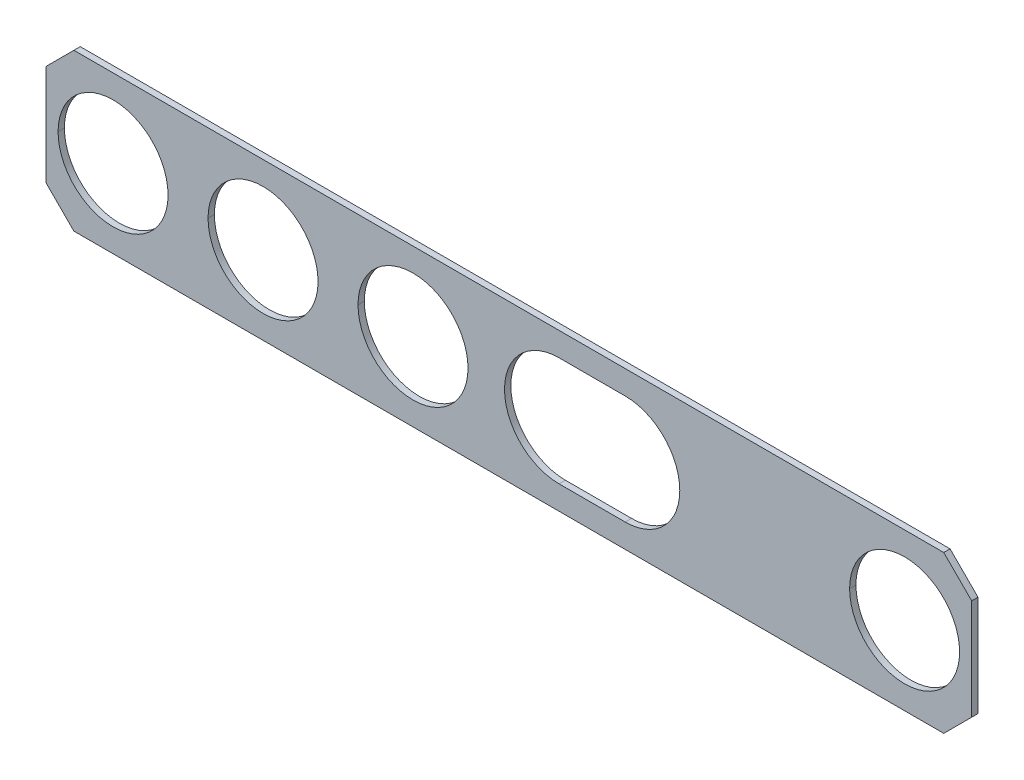
ISO-10303-21;
HEADER;
FILE_DESCRIPTION(('STEP AP214'),'2;1');
FILE_NAME('part.step','',(''),(''),'','','');
FILE_SCHEMA(('AUTOMOTIVE_DESIGN { 1 0 10303 214 1 1 1 1 }'));
ENDSEC;
DATA;
#1=APPLICATION_CONTEXT('core data for automotive mechanical design processes');
#2=APPLICATION_PROTOCOL_DEFINITION('international standard','automotive_design',2000,#1);
#3=PRODUCT_CONTEXT('',#1,'mechanical');
#4=PRODUCT('Part','Part','',(#3));
#5=PRODUCT_RELATED_PRODUCT_CATEGORY('part','',(#4));
#6=PRODUCT_DEFINITION_FORMATION('','',#4);
#7=PRODUCT_DEFINITION_CONTEXT('part definition',#1,'design');
#8=PRODUCT_DEFINITION('design','',#6,#7);
#9=PRODUCT_DEFINITION_SHAPE('','',#8);
#10=(LENGTH_UNIT() NAMED_UNIT(*) SI_UNIT(.MILLI.,.METRE.));
#11=(NAMED_UNIT(*) PLANE_ANGLE_UNIT() SI_UNIT($,.RADIAN.));
#12=(NAMED_UNIT(*) SI_UNIT($,.STERADIAN.) SOLID_ANGLE_UNIT());
#13=UNCERTAINTY_MEASURE_WITH_UNIT(LENGTH_MEASURE(1.E-05),#10,'distance_accuracy_value','');
#14=(GEOMETRIC_REPRESENTATION_CONTEXT(3) GLOBAL_UNCERTAINTY_ASSIGNED_CONTEXT((#13)) GLOBAL_UNIT_ASSIGNED_CONTEXT((#10,
#11,#12)) REPRESENTATION_CONTEXT('',''));
#15=CARTESIAN_POINT('',(0.,0.,0.));
#16=DIRECTION('',(0.,0.,1.));
#17=DIRECTION('',(1.,0.,0.));
#18=AXIS2_PLACEMENT_3D('',#15,#16,#17);
#19=CARTESIAN_POINT('',(13.96785551477,0.,-1.835));
#20=DIRECTION('',(0.,0.,1.));
#21=DIRECTION('',(1.,0.,0.));
#22=AXIS2_PLACEMENT_3D('',#19,#20,#21);
#23=CYLINDRICAL_SURFACE('',#22,6.55);
#24=DIRECTION('',(0.,0.,1.));
#25=VECTOR('',#24,1.);
#26=CARTESIAN_POINT('',(13.96785551477,6.55,-2.595));
#27=LINE('',#26,#25);
#28=CARTESIAN_POINT('',(13.96785551477,6.55,-2.595));
#29=VERTEX_POINT('',#28);
#30=CARTESIAN_POINT('',(13.96785551477,6.55,-1.835));
#31=VERTEX_POINT('',#30);
#32=EDGE_CURVE('E11',#29,#31,#27,.T.);
#33=ORIENTED_EDGE('',*,*,#32,.F.);
#34=CARTESIAN_POINT('',(13.96785551477,0.,-2.595));
#35=DIRECTION('',(0.,0.,-1.));
#36=DIRECTION('',(0.,1.,0.));
#37=AXIS2_PLACEMENT_3D('',#34,#35,#36);
#38=CIRCLE('',#37,6.55);
#39=CARTESIAN_POINT('',(20.51785551477,0.,-2.595));
#40=VERTEX_POINT('',#39);
#41=EDGE_CURVE('E294',#29,#40,#38,.T.);
#42=ORIENTED_EDGE('',*,*,#41,.T.);
#43=CARTESIAN_POINT('',(13.96785551477,0.,-2.595));
#44=DIRECTION('',(0.,0.,-1.));
#45=DIRECTION('',(1.,0.,0.));
#46=AXIS2_PLACEMENT_3D('',#43,#44,#45);
#47=CIRCLE('',#46,6.55);
#48=CARTESIAN_POINT('',(13.96785551477,-6.55,-2.595));
#49=VERTEX_POINT('',#48);
#50=EDGE_CURVE('E297',#40,#49,#47,.T.);
#51=ORIENTED_EDGE('',*,*,#50,.T.);
#52=DIRECTION('',(0.,0.,-1.));
#53=VECTOR('',#52,1.);
#54=CARTESIAN_POINT('',(13.96785551477,-6.55,-1.835));
#55=LINE('',#54,#53);
#56=CARTESIAN_POINT('',(13.96785551477,-6.55,-1.835));
#57=VERTEX_POINT('',#56);
#58=EDGE_CURVE('E304',#57,#49,#55,.T.);
#59=ORIENTED_EDGE('',*,*,#58,.F.);
#60=CARTESIAN_POINT('',(13.96785551477,0.,-1.835));
#61=DIRECTION('',(0.,0.,1.));
#62=DIRECTION('',(0.,-1.,0.));
#63=AXIS2_PLACEMENT_3D('',#60,#61,#62);
#64=CIRCLE('',#63,6.55);
#65=CARTESIAN_POINT('',(20.51785551477,0.,-1.835));
#66=VERTEX_POINT('',#65);
#67=EDGE_CURVE('E323',#57,#66,#64,.T.);
#68=ORIENTED_EDGE('',*,*,#67,.T.);
#69=CARTESIAN_POINT('',(13.96785551477,0.,-1.835));
#70=DIRECTION('',(0.,0.,1.));
#71=DIRECTION('',(1.,0.,0.));
#72=AXIS2_PLACEMENT_3D('',#69,#70,#71);
#73=CIRCLE('',#72,6.55);
#74=EDGE_CURVE('E326',#66,#31,#73,.T.);
#75=ORIENTED_EDGE('',*,*,#74,.T.);
#76=EDGE_LOOP('',(#33,#42,#51,#59,#68,#75));
#77=FACE_BOUND('',#76,.T.);
#78=ADVANCED_FACE('F17',(#77),#23,.F.);
#79=CARTESIAN_POINT('',(6.032144485231,6.55,-1.835));
#80=DIRECTION('',(0.,-1.,0.));
#81=DIRECTION('',(0.,0.,-1.));
#82=AXIS2_PLACEMENT_3D('',#79,#80,#81);
#83=PLANE('',#82);
#84=DIRECTION('',(0.,0.,-1.));
#85=VECTOR('',#84,1.);
#86=CARTESIAN_POINT('',(6.032144485231,6.55,-1.835));
#87=LINE('',#86,#85);
#88=CARTESIAN_POINT('',(6.032144485231,6.55,-1.835));
#89=VERTEX_POINT('',#88);
#90=CARTESIAN_POINT('',(6.032144485231,6.55,-2.595));
#91=VERTEX_POINT('',#90);
#92=EDGE_CURVE('E21',#89,#91,#87,.T.);
#93=ORIENTED_EDGE('',*,*,#92,.T.);
#94=DIRECTION('',(-1.,0.,0.));
#95=VECTOR('',#94,1.);
#96=CARTESIAN_POINT('',(13.96785551477,6.55,-2.595));
#97=LINE('',#96,#95);
#98=EDGE_CURVE('E251',#29,#91,#97,.T.);
#99=ORIENTED_EDGE('',*,*,#98,.F.);
#100=ORIENTED_EDGE('',*,*,#32,.T.);
#101=DIRECTION('',(-1.,0.,0.));
#102=VECTOR('',#101,1.);
#103=CARTESIAN_POINT('',(13.96785551477,6.55,-1.835));
#104=LINE('',#103,#102);
#105=EDGE_CURVE('E382',#31,#89,#104,.T.);
#106=ORIENTED_EDGE('',*,*,#105,.T.);
#107=EDGE_LOOP('',(#93,#99,#100,#106));
#108=FACE_BOUND('',#107,.T.);
#109=ADVANCED_FACE('F448',(#108),#83,.T.);
#110=CARTESIAN_POINT('',(6.032144485231,0.,-1.835));
#111=DIRECTION('',(0.,0.,1.));
#112=DIRECTION('',(1.,0.,0.));
#113=AXIS2_PLACEMENT_3D('',#110,#111,#112);
#114=CYLINDRICAL_SURFACE('',#113,6.55);
#115=DIRECTION('',(0.,0.,1.));
#116=VECTOR('',#115,1.);
#117=CARTESIAN_POINT('',(6.032144485231,-6.55,-2.595));
#118=LINE('',#117,#116);
#119=CARTESIAN_POINT('',(6.032144485231,-6.55,-2.595));
#120=VERTEX_POINT('',#119);
#121=CARTESIAN_POINT('',(6.032144485231,-6.55,-1.835));
#122=VERTEX_POINT('',#121);
#123=EDGE_CURVE('E41',#120,#122,#118,.T.);
#124=ORIENTED_EDGE('',*,*,#123,.F.);
#125=CARTESIAN_POINT('',(6.032144485231,0.,-2.595));
#126=DIRECTION('',(0.,0.,-1.));
#127=DIRECTION('',(0.,-1.,0.));
#128=AXIS2_PLACEMENT_3D('',#125,#126,#127);
#129=CIRCLE('',#128,6.55);
#130=CARTESIAN_POINT('',(-0.517855514769,0.,-2.595));
#131=VERTEX_POINT('',#130);
#132=EDGE_CURVE('E250',#120,#131,#129,.T.);
#133=ORIENTED_EDGE('',*,*,#132,.T.);
#134=CARTESIAN_POINT('',(6.032144485231,0.,-2.595));
#135=DIRECTION('',(0.,0.,-1.));
#136=DIRECTION('',(-1.,0.,0.));
#137=AXIS2_PLACEMENT_3D('',#134,#135,#136);
#138=CIRCLE('',#137,6.55);
#139=EDGE_CURVE('E246',#131,#91,#138,.T.);
#140=ORIENTED_EDGE('',*,*,#139,.T.);
#141=ORIENTED_EDGE('',*,*,#92,.F.);
#142=CARTESIAN_POINT('',(6.032144485231,0.,-1.835));
#143=DIRECTION('',(0.,0.,1.));
#144=DIRECTION('',(0.,1.,0.));
#145=AXIS2_PLACEMENT_3D('',#142,#143,#144);
#146=CIRCLE('',#145,6.55);
#147=CARTESIAN_POINT('',(-0.517855514769,0.,-1.835));
#148=VERTEX_POINT('',#147);
#149=EDGE_CURVE('E334',#89,#148,#146,.T.);
#150=ORIENTED_EDGE('',*,*,#149,.T.);
#151=CARTESIAN_POINT('',(6.032144485231,0.,-1.835));
#152=DIRECTION('',(0.,0.,1.));
#153=DIRECTION('',(-1.,0.,0.));
#154=AXIS2_PLACEMENT_3D('',#151,#152,#153);
#155=CIRCLE('',#154,6.55);
#156=EDGE_CURVE('E331',#148,#122,#155,.T.);
#157=ORIENTED_EDGE('',*,*,#156,.T.);
#158=EDGE_LOOP('',(#124,#133,#140,#141,#150,#157));
#159=FACE_BOUND('',#158,.T.);
#160=ADVANCED_FACE('F446',(#159),#114,.F.);
#161=CARTESIAN_POINT('',(13.96785551477,-6.55,-1.835));
#162=DIRECTION('',(0.,1.,0.));
#163=DIRECTION('',(1.,0.,0.));
#164=AXIS2_PLACEMENT_3D('',#161,#162,#163);
#165=PLANE('',#164);
#166=ORIENTED_EDGE('',*,*,#58,.T.);
#167=DIRECTION('',(1.,0.,0.));
#168=VECTOR('',#167,1.);
#169=CARTESIAN_POINT('',(6.032144485231,-6.55,-2.595));
#170=LINE('',#169,#168);
#171=EDGE_CURVE('E216',#120,#49,#170,.T.);
#172=ORIENTED_EDGE('',*,*,#171,.F.);
#173=ORIENTED_EDGE('',*,*,#123,.T.);
#174=DIRECTION('',(1.,0.,0.));
#175=VECTOR('',#174,1.);
#176=CARTESIAN_POINT('',(6.032144485231,-6.55,-1.835));
#177=LINE('',#176,#175);
#178=EDGE_CURVE('E239',#122,#57,#177,.T.);
#179=ORIENTED_EDGE('',*,*,#178,.T.);
#180=EDGE_LOOP('',(#166,#172,#173,#179));
#181=FACE_BOUND('',#180,.T.);
#182=ADVANCED_FACE('F434',(#181),#165,.T.);
#183=CARTESIAN_POINT('',(47.5,0.,-1.835));
#184=DIRECTION('',(0.,0.,1.));
#185=DIRECTION('',(1.,0.,0.));
#186=AXIS2_PLACEMENT_3D('',#183,#184,#185);
#187=CYLINDRICAL_SURFACE('',#186,6.6);
#188=DIRECTION('',(0.,0.,1.));
#189=VECTOR('',#188,1.);
#190=CARTESIAN_POINT('',(54.1,0.,-2.595));
#191=LINE('',#190,#189);
#192=CARTESIAN_POINT('',(54.1,0.,-2.595));
#193=VERTEX_POINT('',#192);
#194=CARTESIAN_POINT('',(54.1,0.,-1.835));
#195=VERTEX_POINT('',#194);
#196=EDGE_CURVE('E307',#193,#195,#191,.T.);
#197=ORIENTED_EDGE('',*,*,#196,.F.);
#198=CARTESIAN_POINT('',(47.5,0.,-2.595));
#199=DIRECTION('',(0.,0.,-1.));
#200=DIRECTION('',(1.,0.,0.));
#201=AXIS2_PLACEMENT_3D('',#198,#199,#200);
#202=CIRCLE('',#201,6.6);
#203=CARTESIAN_POINT('',(40.9,0.,-2.595));
#204=VERTEX_POINT('',#203);
#205=EDGE_CURVE('E288',#193,#204,#202,.T.);
#206=ORIENTED_EDGE('',*,*,#205,.T.);
#207=DIRECTION('',(0.,0.,1.));
#208=VECTOR('',#207,1.);
#209=CARTESIAN_POINT('',(40.9,0.,-2.595));
#210=LINE('',#209,#208);
#211=CARTESIAN_POINT('',(40.9,0.,-1.835));
#212=VERTEX_POINT('',#211);
#213=EDGE_CURVE('E262',#204,#212,#210,.T.);
#214=ORIENTED_EDGE('',*,*,#213,.T.);
#215=CARTESIAN_POINT('',(47.5,0.,-1.835));
#216=DIRECTION('',(0.,0.,1.));
#217=DIRECTION('',(-1.,0.,0.));
#218=AXIS2_PLACEMENT_3D('',#215,#216,#217);
#219=CIRCLE('',#218,6.6);
#220=EDGE_CURVE('E351',#212,#195,#219,.T.);
#221=ORIENTED_EDGE('',*,*,#220,.T.);
#222=EDGE_LOOP('',(#197,#206,#214,#221));
#223=FACE_BOUND('',#222,.T.);
#224=ADVANCED_FACE('F472',(#223),#187,.F.);
#225=CARTESIAN_POINT('',(47.5,0.,-1.835));
#226=DIRECTION('',(0.,0.,1.));
#227=DIRECTION('',(1.,0.,0.));
#228=AXIS2_PLACEMENT_3D('',#225,#226,#227);
#229=CYLINDRICAL_SURFACE('',#228,6.6);
#230=ORIENTED_EDGE('',*,*,#213,.F.);
#231=CARTESIAN_POINT('',(47.5,0.,-2.595));
#232=DIRECTION('',(0.,0.,-1.));
#233=DIRECTION('',(-1.,0.,0.));
#234=AXIS2_PLACEMENT_3D('',#231,#232,#233);
#235=CIRCLE('',#234,6.6);
#236=EDGE_CURVE('E292',#204,#193,#235,.T.);
#237=ORIENTED_EDGE('',*,*,#236,.T.);
#238=ORIENTED_EDGE('',*,*,#196,.T.);
#239=CARTESIAN_POINT('',(47.5,0.,-1.835));
#240=DIRECTION('',(0.,0.,1.));
#241=DIRECTION('',(1.,0.,0.));
#242=AXIS2_PLACEMENT_3D('',#239,#240,#241);
#243=CIRCLE('',#242,6.6);
#244=EDGE_CURVE('E335',#195,#212,#243,.T.);
#245=ORIENTED_EDGE('',*,*,#244,.T.);
#246=EDGE_LOOP('',(#230,#237,#238,#245));
#247=FACE_BOUND('',#246,.T.);
#248=ADVANCED_FACE('F498',(#247),#229,.F.);
#249=CARTESIAN_POINT('',(-47.5,0.,-1.835));
#250=DIRECTION('',(0.,0.,1.));
#251=DIRECTION('',(1.,0.,0.));
#252=AXIS2_PLACEMENT_3D('',#249,#250,#251);
#253=CYLINDRICAL_SURFACE('',#252,6.6);
#254=DIRECTION('',(0.,0.,1.));
#255=VECTOR('',#254,1.);
#256=CARTESIAN_POINT('',(-54.1,0.,-2.595));
#257=LINE('',#256,#255);
#258=CARTESIAN_POINT('',(-54.1,0.,-2.595));
#259=VERTEX_POINT('',#258);
#260=CARTESIAN_POINT('',(-54.1,0.,-1.835));
#261=VERTEX_POINT('',#260);
#262=EDGE_CURVE('E174',#259,#261,#257,.T.);
#263=ORIENTED_EDGE('',*,*,#262,.F.);
#264=CARTESIAN_POINT('',(-47.5,0.,-2.595));
#265=DIRECTION('',(0.,0.,-1.));
#266=DIRECTION('',(-1.,0.,0.));
#267=AXIS2_PLACEMENT_3D('',#264,#265,#266);
#268=CIRCLE('',#267,6.6);
#269=CARTESIAN_POINT('',(-40.9,0.,-2.595));
#270=VERTEX_POINT('',#269);
#271=EDGE_CURVE('E387',#259,#270,#268,.T.);
#272=ORIENTED_EDGE('',*,*,#271,.T.);
#273=DIRECTION('',(0.,0.,1.));
#274=VECTOR('',#273,1.);
#275=CARTESIAN_POINT('',(-40.9,0.,-2.595));
#276=LINE('',#275,#274);
#277=CARTESIAN_POINT('',(-40.9,0.,-1.835));
#278=VERTEX_POINT('',#277);
#279=EDGE_CURVE('E263',#270,#278,#276,.T.);
#280=ORIENTED_EDGE('',*,*,#279,.T.);
#281=CARTESIAN_POINT('',(-47.5,0.,-1.835));
#282=DIRECTION('',(0.,0.,1.));
#283=DIRECTION('',(1.,0.,0.));
#284=AXIS2_PLACEMENT_3D('',#281,#282,#283);
#285=CIRCLE('',#284,6.6);
#286=EDGE_CURVE('E318',#278,#261,#285,.T.);
#287=ORIENTED_EDGE('',*,*,#286,.T.);
#288=EDGE_LOOP('',(#263,#272,#280,#287));
#289=FACE_BOUND('',#288,.T.);
#290=ADVANCED_FACE('F489',(#289),#253,.F.);
#291=CARTESIAN_POINT('',(-47.5,0.,-1.835));
#292=DIRECTION('',(0.,0.,1.));
#293=DIRECTION('',(1.,0.,0.));
#294=AXIS2_PLACEMENT_3D('',#291,#292,#293);
#295=CYLINDRICAL_SURFACE('',#294,6.6);
#296=ORIENTED_EDGE('',*,*,#279,.F.);
#297=CARTESIAN_POINT('',(-47.5,0.,-2.595));
#298=DIRECTION('',(0.,0.,-1.));
#299=DIRECTION('',(1.,0.,0.));
#300=AXIS2_PLACEMENT_3D('',#297,#298,#299);
#301=CIRCLE('',#300,6.6);
#302=EDGE_CURVE('E293',#270,#259,#301,.T.);
#303=ORIENTED_EDGE('',*,*,#302,.T.);
#304=ORIENTED_EDGE('',*,*,#262,.T.);
#305=CARTESIAN_POINT('',(-47.5,0.,-1.835));
#306=DIRECTION('',(0.,0.,1.));
#307=DIRECTION('',(-1.,0.,0.));
#308=AXIS2_PLACEMENT_3D('',#305,#306,#307);
#309=CIRCLE('',#308,6.6);
#310=EDGE_CURVE('E347',#261,#278,#309,.T.);
#311=ORIENTED_EDGE('',*,*,#310,.T.);
#312=EDGE_LOOP('',(#296,#303,#304,#311));
#313=FACE_BOUND('',#312,.T.);
#314=ADVANCED_FACE('F484',(#313),#295,.F.);
#315=CARTESIAN_POINT('',(-29.5,0.,-1.835));
#316=DIRECTION('',(0.,0.,1.));
#317=DIRECTION('',(1.,0.,0.));
#318=AXIS2_PLACEMENT_3D('',#315,#316,#317);
#319=CYLINDRICAL_SURFACE('',#318,6.6);
#320=DIRECTION('',(0.,0.,1.));
#321=VECTOR('',#320,1.);
#322=CARTESIAN_POINT('',(-36.1,0.,-2.595));
#323=LINE('',#322,#321);
#324=CARTESIAN_POINT('',(-36.1,0.,-2.595));
#325=VERTEX_POINT('',#324);
#326=CARTESIAN_POINT('',(-36.1,0.,-1.835));
#327=VERTEX_POINT('',#326);
#328=EDGE_CURVE('E352',#325,#327,#323,.T.);
#329=ORIENTED_EDGE('',*,*,#328,.F.);
#330=CARTESIAN_POINT('',(-29.5,0.,-2.595));
#331=DIRECTION('',(0.,0.,-1.));
#332=DIRECTION('',(-1.,0.,0.));
#333=AXIS2_PLACEMENT_3D('',#330,#331,#332);
#334=CIRCLE('',#333,6.6);
#335=CARTESIAN_POINT('',(-22.9,0.,-2.595));
#336=VERTEX_POINT('',#335);
#337=EDGE_CURVE('E241',#325,#336,#334,.T.);
#338=ORIENTED_EDGE('',*,*,#337,.T.);
#339=DIRECTION('',(0.,0.,1.));
#340=VECTOR('',#339,1.);
#341=CARTESIAN_POINT('',(-22.9,0.,-2.595));
#342=LINE('',#341,#340);
#343=CARTESIAN_POINT('',(-22.9,0.,-1.835));
#344=VERTEX_POINT('',#343);
#345=EDGE_CURVE('E162',#336,#344,#342,.T.);
#346=ORIENTED_EDGE('',*,*,#345,.T.);
#347=CARTESIAN_POINT('',(-29.5,0.,-1.835));
#348=DIRECTION('',(0.,0.,1.));
#349=DIRECTION('',(1.,0.,0.));
#350=AXIS2_PLACEMENT_3D('',#347,#348,#349);
#351=CIRCLE('',#350,6.6);
#352=EDGE_CURVE('E223',#344,#327,#351,.T.);
#353=ORIENTED_EDGE('',*,*,#352,.T.);
#354=EDGE_LOOP('',(#329,#338,#346,#353));
#355=FACE_BOUND('',#354,.T.);
#356=ADVANCED_FACE('F488',(#355),#319,.F.);
#357=CARTESIAN_POINT('',(-29.5,0.,-1.835));
#358=DIRECTION('',(0.,0.,1.));
#359=DIRECTION('',(1.,0.,0.));
#360=AXIS2_PLACEMENT_3D('',#357,#358,#359);
#361=CYLINDRICAL_SURFACE('',#360,6.6);
#362=ORIENTED_EDGE('',*,*,#345,.F.);
#363=CARTESIAN_POINT('',(-29.5,0.,-2.595));
#364=DIRECTION('',(0.,0.,-1.));
#365=DIRECTION('',(1.,0.,0.));
#366=AXIS2_PLACEMENT_3D('',#363,#364,#365);
#367=CIRCLE('',#366,6.6);
#368=EDGE_CURVE('E244',#336,#325,#367,.T.);
#369=ORIENTED_EDGE('',*,*,#368,.T.);
#370=ORIENTED_EDGE('',*,*,#328,.T.);
#371=CARTESIAN_POINT('',(-29.5,0.,-1.835));
#372=DIRECTION('',(0.,0.,1.));
#373=DIRECTION('',(-1.,0.,0.));
#374=AXIS2_PLACEMENT_3D('',#371,#372,#373);
#375=CIRCLE('',#374,6.6);
#376=EDGE_CURVE('E315',#327,#344,#375,.T.);
#377=ORIENTED_EDGE('',*,*,#376,.T.);
#378=EDGE_LOOP('',(#362,#369,#370,#377));
#379=FACE_BOUND('',#378,.T.);
#380=ADVANCED_FACE('F597',(#379),#361,.F.);
#381=CARTESIAN_POINT('',(-11.5,0.,-1.835));
#382=DIRECTION('',(0.,0.,1.));
#383=DIRECTION('',(1.,0.,0.));
#384=AXIS2_PLACEMENT_3D('',#381,#382,#383);
#385=CYLINDRICAL_SURFACE('',#384,6.6);
#386=DIRECTION('',(0.,0.,1.));
#387=VECTOR('',#386,1.);
#388=CARTESIAN_POINT('',(-18.1,0.,-2.595));
#389=LINE('',#388,#387);
#390=CARTESIAN_POINT('',(-18.1,0.,-2.595));
#391=VERTEX_POINT('',#390);
#392=CARTESIAN_POINT('',(-18.1,0.,-1.835));
#393=VERTEX_POINT('',#392);
#394=EDGE_CURVE('E215',#391,#393,#389,.T.);
#395=ORIENTED_EDGE('',*,*,#394,.F.);
#396=CARTESIAN_POINT('',(-11.5,0.,-2.595));
#397=DIRECTION('',(0.,0.,-1.));
#398=DIRECTION('',(-1.,0.,0.));
#399=AXIS2_PLACEMENT_3D('',#396,#397,#398);
#400=CIRCLE('',#399,6.6);
#401=CARTESIAN_POINT('',(-4.9,0.,-2.595));
#402=VERTEX_POINT('',#401);
#403=EDGE_CURVE('E210',#391,#402,#400,.T.);
#404=ORIENTED_EDGE('',*,*,#403,.T.);
#405=DIRECTION('',(0.,0.,1.));
#406=VECTOR('',#405,1.);
#407=CARTESIAN_POINT('',(-4.9,0.,-2.595));
#408=LINE('',#407,#406);
#409=CARTESIAN_POINT('',(-4.9,0.,-1.835));
#410=VERTEX_POINT('',#409);
#411=EDGE_CURVE('E204',#402,#410,#408,.T.);
#412=ORIENTED_EDGE('',*,*,#411,.T.);
#413=CARTESIAN_POINT('',(-11.5,0.,-1.835));
#414=DIRECTION('',(0.,0.,1.));
#415=DIRECTION('',(1.,0.,0.));
#416=AXIS2_PLACEMENT_3D('',#413,#414,#415);
#417=CIRCLE('',#416,6.6);
#418=EDGE_CURVE('E208',#410,#393,#417,.T.);
#419=ORIENTED_EDGE('',*,*,#418,.T.);
#420=EDGE_LOOP('',(#395,#404,#412,#419));
#421=FACE_BOUND('',#420,.T.);
#422=ADVANCED_FACE('F206',(#421),#385,.F.);
#423=CARTESIAN_POINT('',(-11.5,0.,-1.835));
#424=DIRECTION('',(0.,0.,1.));
#425=DIRECTION('',(1.,0.,0.));
#426=AXIS2_PLACEMENT_3D('',#423,#424,#425);
#427=CYLINDRICAL_SURFACE('',#426,6.6);
#428=ORIENTED_EDGE('',*,*,#411,.F.);
#429=CARTESIAN_POINT('',(-11.5,0.,-2.595));
#430=DIRECTION('',(0.,0.,-1.));
#431=DIRECTION('',(1.,0.,0.));
#432=AXIS2_PLACEMENT_3D('',#429,#430,#431);
#433=CIRCLE('',#432,6.6);
#434=EDGE_CURVE('E245',#402,#391,#433,.T.);
#435=ORIENTED_EDGE('',*,*,#434,.T.);
#436=ORIENTED_EDGE('',*,*,#394,.T.);
#437=CARTESIAN_POINT('',(-11.5,0.,-1.835));
#438=DIRECTION('',(0.,0.,1.));
#439=DIRECTION('',(-1.,0.,0.));
#440=AXIS2_PLACEMENT_3D('',#437,#438,#439);
#441=CIRCLE('',#440,6.6);
#442=EDGE_CURVE('E219',#393,#410,#441,.T.);
#443=ORIENTED_EDGE('',*,*,#442,.T.);
#444=EDGE_LOOP('',(#428,#435,#436,#443));
#445=FACE_BOUND('',#444,.T.);
#446=ADVANCED_FACE('F220',(#445),#427,.F.);
#447=CARTESIAN_POINT('',(0.,0.,-2.595));
#448=DIRECTION('',(0.,0.,1.));
#449=DIRECTION('',(1.,0.,0.));
#450=AXIS2_PLACEMENT_3D('',#447,#448,#449);
#451=PLANE('',#450);
#452=ORIENTED_EDGE('',*,*,#50,.F.);
#453=ORIENTED_EDGE('',*,*,#41,.F.);
#454=ORIENTED_EDGE('',*,*,#98,.T.);
#455=ORIENTED_EDGE('',*,*,#139,.F.);
#456=ORIENTED_EDGE('',*,*,#132,.F.);
#457=ORIENTED_EDGE('',*,*,#171,.T.);
#458=EDGE_LOOP('',(#452,#453,#454,#455,#456,#457));
#459=FACE_BOUND('',#458,.T.);
#460=ORIENTED_EDGE('',*,*,#205,.F.);
#461=ORIENTED_EDGE('',*,*,#236,.F.);
#462=EDGE_LOOP('',(#460,#461));
#463=FACE_BOUND('',#462,.T.);
#464=ORIENTED_EDGE('',*,*,#271,.F.);
#465=ORIENTED_EDGE('',*,*,#302,.F.);
#466=EDGE_LOOP('',(#464,#465));
#467=FACE_BOUND('',#466,.T.);
#468=ORIENTED_EDGE('',*,*,#337,.F.);
#469=ORIENTED_EDGE('',*,*,#368,.F.);
#470=EDGE_LOOP('',(#468,#469));
#471=FACE_BOUND('',#470,.T.);
#472=ORIENTED_EDGE('',*,*,#403,.F.);
#473=ORIENTED_EDGE('',*,*,#434,.F.);
#474=EDGE_LOOP('',(#472,#473));
#475=FACE_BOUND('',#474,.T.);
#476=DIRECTION('',(0.,-1.,0.));
#477=VECTOR('',#476,1.);
#478=CARTESIAN_POINT('',(55.55,6.050050506339,-2.595));
#479=LINE('',#478,#477);
#480=CARTESIAN_POINT('',(55.55,6.050050506339,-2.595));
#481=VERTEX_POINT('',#480);
#482=CARTESIAN_POINT('',(55.55,-6.05005050634,-2.595));
#483=VERTEX_POINT('',#482);
#484=EDGE_CURVE('E363',#481,#483,#479,.T.);
#485=ORIENTED_EDGE('',*,*,#484,.T.);
#486=DIRECTION('',(0.707106781186498,0.707106781186597,0.));
#487=VECTOR('',#486,1.);
#488=CARTESIAN_POINT('',(52.20005050634,-9.4,-2.595));
#489=LINE('',#488,#487);
#490=CARTESIAN_POINT('',(52.20005050634,-9.4,-2.595));
#491=VERTEX_POINT('',#490);
#492=EDGE_CURVE('E364',#491,#483,#489,.T.);
#493=ORIENTED_EDGE('',*,*,#492,.F.);
#494=DIRECTION('',(-1.,0.,0.));
#495=VECTOR('',#494,1.);
#496=CARTESIAN_POINT('',(52.20005050634,-9.4,-2.595));
#497=LINE('',#496,#495);
#498=CARTESIAN_POINT('',(-52.20005050634,-9.4,-2.595));
#499=VERTEX_POINT('',#498);
#500=EDGE_CURVE('E272',#491,#499,#497,.T.);
#501=ORIENTED_EDGE('',*,*,#500,.T.);
#502=DIRECTION('',(0.707106781186498,-0.707106781186597,0.));
#503=VECTOR('',#502,1.);
#504=CARTESIAN_POINT('',(-55.55,-6.050050506339,-2.595));
#505=LINE('',#504,#503);
#506=CARTESIAN_POINT('',(-55.55,-6.050050506339,-2.595));
#507=VERTEX_POINT('',#506);
#508=EDGE_CURVE('E273',#507,#499,#505,.T.);
#509=ORIENTED_EDGE('',*,*,#508,.F.);
#510=DIRECTION('',(0.,1.,0.));
#511=VECTOR('',#510,1.);
#512=CARTESIAN_POINT('',(-55.55,-6.050050506339,-2.595));
#513=LINE('',#512,#511);
#514=CARTESIAN_POINT('',(-55.55,6.05005050634,-2.595));
#515=VERTEX_POINT('',#514);
#516=EDGE_CURVE('E266',#507,#515,#513,.T.);
#517=ORIENTED_EDGE('',*,*,#516,.T.);
#518=DIRECTION('',(-0.707106781186498,-0.707106781186597,0.));
#519=VECTOR('',#518,1.);
#520=CARTESIAN_POINT('',(-52.20005050634,9.4,-2.595));
#521=LINE('',#520,#519);
#522=CARTESIAN_POINT('',(-52.20005050634,9.4,-2.595));
#523=VERTEX_POINT('',#522);
#524=EDGE_CURVE('E252',#523,#515,#521,.T.);
#525=ORIENTED_EDGE('',*,*,#524,.F.);
#526=DIRECTION('',(1.,0.,0.));
#527=VECTOR('',#526,1.);
#528=CARTESIAN_POINT('',(-52.20005050634,9.4,-2.595));
#529=LINE('',#528,#527);
#530=CARTESIAN_POINT('',(52.20005050634,9.4,-2.595));
#531=VERTEX_POINT('',#530);
#532=EDGE_CURVE('E390',#523,#531,#529,.T.);
#533=ORIENTED_EDGE('',*,*,#532,.T.);
#534=DIRECTION('',(-0.707106781186498,0.707106781186597,0.));
#535=VECTOR('',#534,1.);
#536=CARTESIAN_POINT('',(55.55,6.050050506339,-2.595));
#537=LINE('',#536,#535);
#538=EDGE_CURVE('E274',#481,#531,#537,.T.);
#539=ORIENTED_EDGE('',*,*,#538,.F.);
#540=EDGE_LOOP('',(#485,#493,#501,#509,#517,#525,#533,#539));
#541=FACE_BOUND('',#540,.T.);
#542=ADVANCED_FACE('F442',(#459,#463,#467,#471,#475,#541),#451,.F.);
#543=CARTESIAN_POINT('',(55.55,-6.050050506339,-1.835));
#544=DIRECTION('',(1.,0.,0.));
#545=DIRECTION('',(0.,1.,0.));
#546=AXIS2_PLACEMENT_3D('',#543,#544,#545);
#547=PLANE('',#546);
#548=DIRECTION('',(0.,0.,1.));
#549=VECTOR('',#548,1.);
#550=CARTESIAN_POINT('',(55.55,-6.050050506339,-2.595));
#551=LINE('',#550,#549);
#552=CARTESIAN_POINT('',(55.55,-6.05005050634,-1.835));
#553=VERTEX_POINT('',#552);
#554=EDGE_CURVE('E360',#483,#553,#551,.T.);
#555=ORIENTED_EDGE('',*,*,#554,.F.);
#556=ORIENTED_EDGE('',*,*,#484,.F.);
#557=DIRECTION('',(0.,0.,1.));
#558=VECTOR('',#557,1.);
#559=CARTESIAN_POINT('',(55.55,6.050050506339,-2.595));
#560=LINE('',#559,#558);
#561=CARTESIAN_POINT('',(55.55,6.050050506339,-1.835));
#562=VERTEX_POINT('',#561);
#563=EDGE_CURVE('E279',#481,#562,#560,.T.);
#564=ORIENTED_EDGE('',*,*,#563,.T.);
#565=DIRECTION('',(0.,-1.,0.));
#566=VECTOR('',#565,1.);
#567=CARTESIAN_POINT('',(55.55,6.050050506339,-1.835));
#568=LINE('',#567,#566);
#569=EDGE_CURVE('E235',#562,#553,#568,.T.);
#570=ORIENTED_EDGE('',*,*,#569,.T.);
#571=EDGE_LOOP('',(#555,#556,#564,#570));
#572=FACE_BOUND('',#571,.T.);
#573=ADVANCED_FACE('F525',(#572),#547,.T.);
#574=CARTESIAN_POINT('',(52.20005050634,-9.4,-1.835));
#575=DIRECTION('',(0.707106781186548,-0.707106781186548,0.));
#576=DIRECTION('',(0.,0.,-1.));
#577=AXIS2_PLACEMENT_3D('',#574,#575,#576);
#578=PLANE('',#577);
#579=DIRECTION('',(0.,0.,1.));
#580=VECTOR('',#579,1.);
#581=CARTESIAN_POINT('',(52.20005050634,-9.4,-2.595));
#582=LINE('',#581,#580);
#583=CARTESIAN_POINT('',(52.20005050634,-9.4,-1.835));
#584=VERTEX_POINT('',#583);
#585=EDGE_CURVE('E329',#491,#584,#582,.T.);
#586=ORIENTED_EDGE('',*,*,#585,.F.);
#587=ORIENTED_EDGE('',*,*,#492,.T.);
#588=ORIENTED_EDGE('',*,*,#554,.T.);
#589=DIRECTION('',(-0.707106781186498,-0.707106781186597,0.));
#590=VECTOR('',#589,1.);
#591=CARTESIAN_POINT('',(55.55,-6.05005050634,-1.835));
#592=LINE('',#591,#590);
#593=EDGE_CURVE('E283',#553,#584,#592,.T.);
#594=ORIENTED_EDGE('',*,*,#593,.T.);
#595=EDGE_LOOP('',(#586,#587,#588,#594));
#596=FACE_BOUND('',#595,.T.);
#597=ADVANCED_FACE('F529',(#596),#578,.T.);
#598=CARTESIAN_POINT('',(-52.20005050634,-9.4,-1.835));
#599=DIRECTION('',(0.,-1.,0.));
#600=DIRECTION('',(0.,0.,-1.));
#601=AXIS2_PLACEMENT_3D('',#598,#599,#600);
#602=PLANE('',#601);
#603=DIRECTION('',(0.,0.,1.));
#604=VECTOR('',#603,1.);
#605=CARTESIAN_POINT('',(-52.20005050634,-9.4,-2.595));
#606=LINE('',#605,#604);
#607=CARTESIAN_POINT('',(-52.20005050634,-9.4,-1.835));
#608=VERTEX_POINT('',#607);
#609=EDGE_CURVE('E269',#499,#608,#606,.T.);
#610=ORIENTED_EDGE('',*,*,#609,.F.);
#611=ORIENTED_EDGE('',*,*,#500,.F.);
#612=ORIENTED_EDGE('',*,*,#585,.T.);
#613=DIRECTION('',(-1.,0.,0.));
#614=VECTOR('',#613,1.);
#615=CARTESIAN_POINT('',(52.20005050634,-9.4,-1.835));
#616=LINE('',#615,#614);
#617=EDGE_CURVE('E371',#584,#608,#616,.T.);
#618=ORIENTED_EDGE('',*,*,#617,.T.);
#619=EDGE_LOOP('',(#610,#611,#612,#618));
#620=FACE_BOUND('',#619,.T.);
#621=ADVANCED_FACE('F534',(#620),#602,.T.);
#622=CARTESIAN_POINT('',(-55.55,-6.050050506339,-1.835));
#623=DIRECTION('',(-0.707106781186548,-0.707106781186548,0.));
#624=DIRECTION('',(-0.707106781186548,0.707106781186548,0.));
#625=AXIS2_PLACEMENT_3D('',#622,#623,#624);
#626=PLANE('',#625);
#627=DIRECTION('',(0.,0.,1.));
#628=VECTOR('',#627,1.);
#629=CARTESIAN_POINT('',(-55.55,-6.050050506339,-2.595));
#630=LINE('',#629,#628);
#631=CARTESIAN_POINT('',(-55.55,-6.050050506339,-1.835));
#632=VERTEX_POINT('',#631);
#633=EDGE_CURVE('E284',#507,#632,#630,.T.);
#634=ORIENTED_EDGE('',*,*,#633,.F.);
#635=ORIENTED_EDGE('',*,*,#508,.T.);
#636=ORIENTED_EDGE('',*,*,#609,.T.);
#637=DIRECTION('',(-0.707106781186498,0.707106781186597,0.));
#638=VECTOR('',#637,1.);
#639=CARTESIAN_POINT('',(-52.20005050634,-9.4,-1.835));
#640=LINE('',#639,#638);
#641=EDGE_CURVE('E302',#608,#632,#640,.T.);
#642=ORIENTED_EDGE('',*,*,#641,.T.);
#643=EDGE_LOOP('',(#634,#635,#636,#642));
#644=FACE_BOUND('',#643,.T.);
#645=ADVANCED_FACE('F538',(#644),#626,.T.);
#646=CARTESIAN_POINT('',(-55.55,6.050050506339,-1.835));
#647=DIRECTION('',(-1.,0.,0.));
#648=DIRECTION('',(0.,0.,1.));
#649=AXIS2_PLACEMENT_3D('',#646,#647,#648);
#650=PLANE('',#649);
#651=DIRECTION('',(0.,0.,1.));
#652=VECTOR('',#651,1.);
#653=CARTESIAN_POINT('',(-55.55,6.050050506339,-2.595));
#654=LINE('',#653,#652);
#655=CARTESIAN_POINT('',(-55.55,6.05005050634,-1.835));
#656=VERTEX_POINT('',#655);
#657=EDGE_CURVE('E256',#515,#656,#654,.T.);
#658=ORIENTED_EDGE('',*,*,#657,.F.);
#659=ORIENTED_EDGE('',*,*,#516,.F.);
#660=ORIENTED_EDGE('',*,*,#633,.T.);
#661=DIRECTION('',(0.,1.,0.));
#662=VECTOR('',#661,1.);
#663=CARTESIAN_POINT('',(-55.55,-6.050050506339,-1.835));
#664=LINE('',#663,#662);
#665=EDGE_CURVE('E298',#632,#656,#664,.T.);
#666=ORIENTED_EDGE('',*,*,#665,.T.);
#667=EDGE_LOOP('',(#658,#659,#660,#666));
#668=FACE_BOUND('',#667,.T.);
#669=ADVANCED_FACE('F549',(#668),#650,.T.);
#670=CARTESIAN_POINT('',(-52.20005050634,9.4,-1.835));
#671=DIRECTION('',(-0.707106781186548,0.707106781186548,0.));
#672=DIRECTION('',(0.,0.,1.));
#673=AXIS2_PLACEMENT_3D('',#670,#671,#672);
#674=PLANE('',#673);
#675=DIRECTION('',(0.,0.,1.));
#676=VECTOR('',#675,1.);
#677=CARTESIAN_POINT('',(-52.20005050634,9.4,-2.595));
#678=LINE('',#677,#676);
#679=CARTESIAN_POINT('',(-52.20005050634,9.4,-1.835));
#680=VERTEX_POINT('',#679);
#681=EDGE_CURVE('E257',#523,#680,#678,.T.);
#682=ORIENTED_EDGE('',*,*,#681,.F.);
#683=ORIENTED_EDGE('',*,*,#524,.T.);
#684=ORIENTED_EDGE('',*,*,#657,.T.);
#685=DIRECTION('',(0.707106781186498,0.707106781186597,0.));
#686=VECTOR('',#685,1.);
#687=CARTESIAN_POINT('',(-55.55,6.05005050634,-1.835));
#688=LINE('',#687,#686);
#689=EDGE_CURVE('E303',#656,#680,#688,.T.);
#690=ORIENTED_EDGE('',*,*,#689,.T.);
#691=EDGE_LOOP('',(#682,#683,#684,#690));
#692=FACE_BOUND('',#691,.T.);
#693=ADVANCED_FACE('F544',(#692),#674,.T.);
#694=CARTESIAN_POINT('',(52.20005050634,9.4,-1.835));
#695=DIRECTION('',(0.,1.,0.));
#696=DIRECTION('',(1.,0.,0.));
#697=AXIS2_PLACEMENT_3D('',#694,#695,#696);
#698=PLANE('',#697);
#699=DIRECTION('',(0.,0.,1.));
#700=VECTOR('',#699,1.);
#701=CARTESIAN_POINT('',(52.20005050634,9.4,-2.595));
#702=LINE('',#701,#700);
#703=CARTESIAN_POINT('',(52.20005050634,9.4,-1.835));
#704=VERTEX_POINT('',#703);
#705=EDGE_CURVE('E278',#531,#704,#702,.T.);
#706=ORIENTED_EDGE('',*,*,#705,.F.);
#707=ORIENTED_EDGE('',*,*,#532,.F.);
#708=ORIENTED_EDGE('',*,*,#681,.T.);
#709=DIRECTION('',(1.,0.,0.));
#710=VECTOR('',#709,1.);
#711=CARTESIAN_POINT('',(-52.20005050634,9.4,-1.835));
#712=LINE('',#711,#710);
#713=EDGE_CURVE('E319',#680,#704,#712,.T.);
#714=ORIENTED_EDGE('',*,*,#713,.T.);
#715=EDGE_LOOP('',(#706,#707,#708,#714));
#716=FACE_BOUND('',#715,.T.);
#717=ADVANCED_FACE('F548',(#716),#698,.T.);
#718=CARTESIAN_POINT('',(55.55,6.050050506339,-1.835));
#719=DIRECTION('',(0.707106781186548,0.707106781186548,0.));
#720=DIRECTION('',(0.,0.,-1.));
#721=AXIS2_PLACEMENT_3D('',#718,#719,#720);
#722=PLANE('',#721);
#723=ORIENTED_EDGE('',*,*,#563,.F.);
#724=ORIENTED_EDGE('',*,*,#538,.T.);
#725=ORIENTED_EDGE('',*,*,#705,.T.);
#726=DIRECTION('',(0.707106781186498,-0.707106781186597,0.));
#727=VECTOR('',#726,1.);
#728=CARTESIAN_POINT('',(52.20005050634,9.4,-1.835));
#729=LINE('',#728,#727);
#730=EDGE_CURVE('E228',#704,#562,#729,.T.);
#731=ORIENTED_EDGE('',*,*,#730,.T.);
#732=EDGE_LOOP('',(#723,#724,#725,#731));
#733=FACE_BOUND('',#732,.T.);
#734=ADVANCED_FACE('F19',(#733),#722,.T.);
#735=CARTESIAN_POINT('',(0.,0.,-1.835));
#736=DIRECTION('',(0.,0.,1.));
#737=DIRECTION('',(1.,0.,0.));
#738=AXIS2_PLACEMENT_3D('',#735,#736,#737);
#739=PLANE('',#738);
#740=ORIENTED_EDGE('',*,*,#156,.F.);
#741=ORIENTED_EDGE('',*,*,#149,.F.);
#742=ORIENTED_EDGE('',*,*,#105,.F.);
#743=ORIENTED_EDGE('',*,*,#74,.F.);
#744=ORIENTED_EDGE('',*,*,#67,.F.);
#745=ORIENTED_EDGE('',*,*,#178,.F.);
#746=EDGE_LOOP('',(#740,#741,#742,#743,#744,#745));
#747=FACE_BOUND('',#746,.T.);
#748=ORIENTED_EDGE('',*,*,#220,.F.);
#749=ORIENTED_EDGE('',*,*,#244,.F.);
#750=EDGE_LOOP('',(#748,#749));
#751=FACE_BOUND('',#750,.T.);
#752=ORIENTED_EDGE('',*,*,#286,.F.);
#753=ORIENTED_EDGE('',*,*,#310,.F.);
#754=EDGE_LOOP('',(#752,#753));
#755=FACE_BOUND('',#754,.T.);
#756=ORIENTED_EDGE('',*,*,#352,.F.);
#757=ORIENTED_EDGE('',*,*,#376,.F.);
#758=EDGE_LOOP('',(#756,#757));
#759=FACE_BOUND('',#758,.T.);
#760=ORIENTED_EDGE('',*,*,#418,.F.);
#761=ORIENTED_EDGE('',*,*,#442,.F.);
#762=EDGE_LOOP('',(#760,#761));
#763=FACE_BOUND('',#762,.T.);
#764=ORIENTED_EDGE('',*,*,#713,.F.);
#765=ORIENTED_EDGE('',*,*,#689,.F.);
#766=ORIENTED_EDGE('',*,*,#665,.F.);
#767=ORIENTED_EDGE('',*,*,#641,.F.);
#768=ORIENTED_EDGE('',*,*,#617,.F.);
#769=ORIENTED_EDGE('',*,*,#593,.F.);
#770=ORIENTED_EDGE('',*,*,#569,.F.);
#771=ORIENTED_EDGE('',*,*,#730,.F.);
#772=EDGE_LOOP('',(#764,#765,#766,#767,#768,#769,#770,#771));
#773=FACE_BOUND('',#772,.T.);
#774=ADVANCED_FACE('F225',(#747,#751,#755,#759,#763,#773),#739,.T.);
#775=CLOSED_SHELL('',(#78,#109,#160,#182,#224,#248,#290,#314,#356,#380,#422,#446,#542,#573,#597,
#621,#645,#669,#693,#717,#734,#774));
#776=MANIFOLD_SOLID_BREP('B1',#775);
#777=ADVANCED_BREP_SHAPE_REPRESENTATION('',(#18,#776),#14);
#778=SHAPE_DEFINITION_REPRESENTATION(#9,#777);
ENDSEC;
END-ISO-10303-21;
